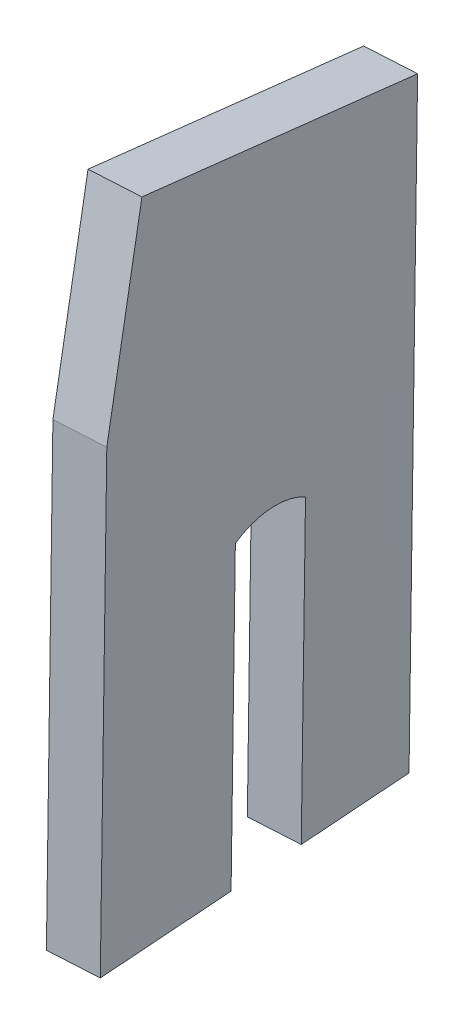
ISO-10303-21;
HEADER;
FILE_DESCRIPTION(('STEP AP214'),'2;1');
FILE_NAME('part.step','',(''),(''),'','','');
FILE_SCHEMA(('AUTOMOTIVE_DESIGN { 1 0 10303 214 1 1 1 1 }'));
ENDSEC;
DATA;
#1=APPLICATION_CONTEXT('core data for automotive mechanical design processes');
#2=APPLICATION_PROTOCOL_DEFINITION('international standard','automotive_design',2000,#1);
#3=PRODUCT_CONTEXT('',#1,'mechanical');
#4=PRODUCT('Part','Part','',(#3));
#5=PRODUCT_RELATED_PRODUCT_CATEGORY('part','',(#4));
#6=PRODUCT_DEFINITION_FORMATION('','',#4);
#7=PRODUCT_DEFINITION_CONTEXT('part definition',#1,'design');
#8=PRODUCT_DEFINITION('design','',#6,#7);
#9=PRODUCT_DEFINITION_SHAPE('','',#8);
#10=(LENGTH_UNIT() NAMED_UNIT(*) SI_UNIT(.MILLI.,.METRE.));
#11=(NAMED_UNIT(*) PLANE_ANGLE_UNIT() SI_UNIT($,.RADIAN.));
#12=(NAMED_UNIT(*) SI_UNIT($,.STERADIAN.) SOLID_ANGLE_UNIT());
#13=UNCERTAINTY_MEASURE_WITH_UNIT(LENGTH_MEASURE(1.E-05),#10,'distance_accuracy_value','');
#14=(GEOMETRIC_REPRESENTATION_CONTEXT(3) GLOBAL_UNCERTAINTY_ASSIGNED_CONTEXT((#13)) GLOBAL_UNIT_ASSIGNED_CONTEXT((#10,
#11,#12)) REPRESENTATION_CONTEXT('',''));
#15=CARTESIAN_POINT('',(0.,0.,0.));
#16=DIRECTION('',(0.,0.,1.));
#17=DIRECTION('',(1.,0.,0.));
#18=AXIS2_PLACEMENT_3D('',#15,#16,#17);
#19=CARTESIAN_POINT('',(126.75340609161,-829.436471035109,138.141208575383));
#20=DIRECTION('',(-9.43475305049383E-05,0.984578657522092,-0.174942442679125));
#21=DIRECTION('',(0.,0.174942443457746,0.984578661904184));
#22=AXIS2_PLACEMENT_3D('',#19,#20,#21);
#23=PLANE('',#22);
#24=DIRECTION('',(-0.0715965086803586,-0.174500135414766,-0.982050733254149));
#25=VECTOR('',#24,1.);
#26=CARTESIAN_POINT('',(120.419702271214,-829.357523935864,138.588939824042));
#27=LINE('',#26,#25);
#28=CARTESIAN_POINT('',(121.704287262103,-826.226641452996,156.208900007596));
#29=VERTEX_POINT('',#28);
#30=CARTESIAN_POINT('',(118.976457912932,-832.875102384852,118.792734583875));
#31=VERTEX_POINT('',#30);
#32=EDGE_CURVE('E185',#29,#31,#27,.T.);
#33=ORIENTED_EDGE('',*,*,#32,.F.);
#34=DIRECTION('',(-0.997433672503253,0.012432614054326,0.0705088580566254));
#35=VECTOR('',#34,1.);
#36=CARTESIAN_POINT('',(128.037991082499,-826.305588552241,155.761168758936));
#37=LINE('',#36,#35);
#38=CARTESIAN_POINT('',(128.037991082499,-826.305588552241,155.761168758936));
#39=VERTEX_POINT('',#38);
#40=EDGE_CURVE('E11',#39,#29,#37,.T.);
#41=ORIENTED_EDGE('',*,*,#40,.F.);
#42=DIRECTION('',(-0.0715965086803586,-0.174500135414766,-0.982050733254149));
#43=VECTOR('',#42,1.);
#44=CARTESIAN_POINT('',(126.75340609161,-829.436471035109,138.141208575383));
#45=LINE('',#44,#43);
#46=CARTESIAN_POINT('',(125.310161733328,-832.954049484097,118.345003335215));
#47=VERTEX_POINT('',#46);
#48=EDGE_CURVE('E148',#39,#47,#45,.T.);
#49=ORIENTED_EDGE('',*,*,#48,.T.);
#50=DIRECTION('',(-0.997433672503253,0.012432614054326,0.0705088580566254));
#51=VECTOR('',#50,1.);
#52=CARTESIAN_POINT('',(125.310161733328,-832.954049484097,118.345003335215));
#53=LINE('',#52,#51);
#54=EDGE_CURVE('E55',#47,#31,#53,.T.);
#55=ORIENTED_EDGE('',*,*,#54,.T.);
#56=EDGE_LOOP('',(#33,#41,#49,#55));
#57=FACE_BOUND('',#56,.T.);
#58=ADVANCED_FACE('F39',(#57),#23,.T.);
#59=CARTESIAN_POINT('',(128.037991082499,1.72056639398182,9.7578169096347));
#60=DIRECTION('',(-0.071596570844372,-0.173202539573817,-0.982280413796644));
#61=DIRECTION('',(0.,0.984807753012209,-0.173648177666924));
#62=AXIS2_PLACEMENT_3D('',#59,#60,#61);
#63=PLANE('',#62);
#64=DIRECTION('',(0.,-0.984807753012209,0.173648177666924));
#65=VECTOR('',#64,1.);
#66=CARTESIAN_POINT('',(121.704287262103,1.79951349322679,10.2055481582943));
#67=LINE('',#66,#65);
#68=CARTESIAN_POINT('',(121.704287262103,-851.2902025536,160.628282062267));
#69=VERTEX_POINT('',#68);
#70=EDGE_CURVE('E180',#29,#69,#67,.T.);
#71=ORIENTED_EDGE('',*,*,#70,.T.);
#72=DIRECTION('',(-0.997433672503253,0.012432614054326,0.0705088580566254));
#73=VECTOR('',#72,1.);
#74=CARTESIAN_POINT('',(128.037991082499,-851.369149652844,160.180550813607));
#75=LINE('',#74,#73);
#76=CARTESIAN_POINT('',(128.037991082499,-851.369149652844,160.180550813607));
#77=VERTEX_POINT('',#76);
#78=EDGE_CURVE('E47',#77,#69,#75,.T.);
#79=ORIENTED_EDGE('',*,*,#78,.F.);
#80=DIRECTION('',(0.,-0.984807753012209,0.173648177666924));
#81=VECTOR('',#80,1.);
#82=CARTESIAN_POINT('',(128.037991082499,1.72056639398182,9.7578169096347));
#83=LINE('',#82,#81);
#84=EDGE_CURVE('E145',#39,#77,#83,.T.);
#85=ORIENTED_EDGE('',*,*,#84,.F.);
#86=ORIENTED_EDGE('',*,*,#40,.T.);
#87=EDGE_LOOP('',(#71,#79,#85,#86));
#88=FACE_BOUND('',#87,.T.);
#89=ADVANCED_FACE('F206',(#88),#63,.F.);
#90=CARTESIAN_POINT('',(138.526775227402,-1.43124847286107,158.69019330866));
#91=DIRECTION('',(-0.0705251801137626,-0.000878796609681126,-0.997509612327841));
#92=DIRECTION('',(-0.997509997508162,0.,0.0705252073464942));
#93=AXIS2_PLACEMENT_3D('',#90,#91,#92);
#94=PLANE('',#93);
#95=DIRECTION('',(-0.0123396890801398,-0.999922325895514,0.00175335367524389));
#96=VECTOR('',#95,1.);
#97=CARTESIAN_POINT('',(132.193071407006,-1.3523013736161,159.137924557319));
#98=LINE('',#97,#96);
#99=CARTESIAN_POINT('',(120.986681425723,-909.439973777887,160.7302470974));
#100=VERTEX_POINT('',#99);
#101=EDGE_CURVE('E175',#69,#100,#98,.T.);
#102=ORIENTED_EDGE('',*,*,#101,.T.);
#103=DIRECTION('',(-0.997433672503253,0.012432614054326,0.0705088580566254));
#104=VECTOR('',#103,1.);
#105=CARTESIAN_POINT('',(127.320385246119,-909.518920877132,160.282515848741));
#106=LINE('',#105,#104);
#107=CARTESIAN_POINT('',(127.320385246119,-909.518920877132,160.282515848741));
#108=VERTEX_POINT('',#107);
#109=EDGE_CURVE('E168',#108,#100,#106,.T.);
#110=ORIENTED_EDGE('',*,*,#109,.F.);
#111=DIRECTION('',(-0.0123396890801398,-0.999922325895514,0.00175335367524389));
#112=VECTOR('',#111,1.);
#113=CARTESIAN_POINT('',(138.526775227402,-1.43124847286107,158.69019330866));
#114=LINE('',#113,#112);
#115=EDGE_CURVE('E141',#77,#108,#114,.T.);
#116=ORIENTED_EDGE('',*,*,#115,.F.);
#117=ORIENTED_EDGE('',*,*,#78,.T.);
#118=EDGE_LOOP('',(#102,#110,#116,#117));
#119=FACE_BOUND('',#118,.T.);
#120=ADVANCED_FACE('F174',(#119),#94,.F.);
#121=CARTESIAN_POINT('',(115.46768642663,-909.66661438917,-7.36230243311104));
#122=DIRECTION('',(0.0123396890801398,0.999922325895514,-0.00175335367524318));
#123=DIRECTION('',(-0.999923862904219,0.0123397080478226,0.));
#124=AXIS2_PLACEMENT_3D('',#121,#122,#123);
#125=PLANE('',#124);
#126=DIRECTION('',(-0.0705251801137626,-0.000878796609680408,-0.997509612327841));
#127=VECTOR('',#126,1.);
#128=CARTESIAN_POINT('',(109.133982606235,-909.587667289925,-6.91457118445146));
#129=LINE('',#128,#127);
#130=CARTESIAN_POINT('',(119.73466670207,-909.45557481985,143.021724841864));
#131=VERTEX_POINT('',#130);
#132=EDGE_CURVE('E157',#100,#131,#129,.T.);
#133=ORIENTED_EDGE('',*,*,#132,.T.);
#134=DIRECTION('',(-0.997433672503253,0.012432614054326,0.0705088580566254));
#135=VECTOR('',#134,1.);
#136=CARTESIAN_POINT('',(126.068370522465,-909.534521919095,142.573993593204));
#137=LINE('',#136,#135);
#138=CARTESIAN_POINT('',(126.068370522465,-909.534521919095,142.573993593204));
#139=VERTEX_POINT('',#138);
#140=EDGE_CURVE('E166',#139,#131,#137,.T.);
#141=ORIENTED_EDGE('',*,*,#140,.F.);
#142=DIRECTION('',(-0.0705251801137626,-0.000878796609680408,-0.997509612327841));
#143=VECTOR('',#142,1.);
#144=CARTESIAN_POINT('',(115.46768642663,-909.66661438917,-7.36230243311104));
#145=LINE('',#144,#143);
#146=EDGE_CURVE('E136',#108,#139,#145,.T.);
#147=ORIENTED_EDGE('',*,*,#146,.F.);
#148=ORIENTED_EDGE('',*,*,#109,.T.);
#149=EDGE_LOOP('',(#133,#141,#147,#148));
#150=FACE_BOUND('',#149,.T.);
#151=ADVANCED_FACE('F198',(#150),#125,.F.);
#152=CARTESIAN_POINT('',(137.274760503748,-1.44684951482426,140.981671053123));
#153=DIRECTION('',(-0.0705251801137626,-0.000878796609681253,-0.997509612327841));
#154=DIRECTION('',(-0.997509997508162,0.,0.0705252073464942));
#155=AXIS2_PLACEMENT_3D('',#152,#153,#154);
#156=PLANE('',#155);
#157=DIRECTION('',(-0.0123396890801398,-0.999922325895514,0.00175335367524402));
#158=VECTOR('',#157,1.);
#159=CARTESIAN_POINT('',(130.941056683353,-1.36790241557929,141.429402301783));
#160=LINE('',#159,#158);
#161=CARTESIAN_POINT('',(120.204808856023,-871.358534203231,142.954922066837));
#162=VERTEX_POINT('',#161);
#163=EDGE_CURVE('E184',#162,#131,#160,.T.);
#164=ORIENTED_EDGE('',*,*,#163,.F.);
#165=DIRECTION('',(-0.997433672503253,0.012432614054326,0.0705088580566254));
#166=VECTOR('',#165,1.);
#167=CARTESIAN_POINT('',(126.538512676419,-871.437481302476,142.507190818178));
#168=LINE('',#167,#166);
#169=CARTESIAN_POINT('',(126.538512676419,-871.437481302476,142.507190818178));
#170=VERTEX_POINT('',#169);
#171=EDGE_CURVE('E164',#170,#162,#168,.T.);
#172=ORIENTED_EDGE('',*,*,#171,.F.);
#173=DIRECTION('',(-0.0123396890801398,-0.999922325895514,0.00175335367524402));
#174=VECTOR('',#173,1.);
#175=CARTESIAN_POINT('',(137.274760503748,-1.44684951482426,140.981671053123));
#176=LINE('',#175,#174);
#177=EDGE_CURVE('E140',#170,#139,#176,.T.);
#178=ORIENTED_EDGE('',*,*,#177,.T.);
#179=ORIENTED_EDGE('',*,*,#140,.T.);
#180=EDGE_LOOP('',(#164,#172,#178,#179));
#181=FACE_BOUND('',#180,.T.);
#182=ADVANCED_FACE('F196',(#181),#156,.T.);
#183=CARTESIAN_POINT('',(126.100847743949,-879.689917817079,137.77101451452));
#184=DIRECTION('',(-0.997433672503253,0.012432614054326,0.0705088580566254));
#185=DIRECTION('',(0.0705143079617223,0.,0.997510768048485));
#186=AXIS2_PLACEMENT_3D('',#183,#184,#185);
#187=CYLINDRICAL_SURFACE('',#186,9.52499999999998);
#188=CARTESIAN_POINT('',(119.767143923553,-879.610970717834,138.21874576318));
#189=DIRECTION('',(0.997433672503253,-0.012432614054326,-0.0705088580566255));
#190=DIRECTION('',(-0.0705143079617224,0.,-0.997510768048485));
#191=AXIS2_PLACEMENT_3D('',#188,#189,#190);
#192=CIRCLE('',#191,9.52499999999998);
#193=CARTESIAN_POINT('',(119.533056515439,-871.366904740938,133.453643009414));
#194=VERTEX_POINT('',#193);
#195=EDGE_CURVE('E189',#194,#162,#192,.T.);
#196=ORIENTED_EDGE('',*,*,#195,.F.);
#197=DIRECTION('',(-0.997433672503253,0.012432614054326,0.0705088580566254));
#198=VECTOR('',#197,1.);
#199=CARTESIAN_POINT('',(125.866760335835,-871.445851840183,133.005911760755));
#200=LINE('',#199,#198);
#201=CARTESIAN_POINT('',(125.866760335835,-871.445851840183,133.005911760755));
#202=VERTEX_POINT('',#201);
#203=EDGE_CURVE('E131',#202,#194,#200,.T.);
#204=ORIENTED_EDGE('',*,*,#203,.F.);
#205=CARTESIAN_POINT('',(126.100847743949,-879.689917817079,137.77101451452));
#206=DIRECTION('',(0.997433672503253,-0.012432614054326,-0.0705088580566255));
#207=DIRECTION('',(-0.0705143079617224,0.,-0.997510768048485));
#208=AXIS2_PLACEMENT_3D('',#205,#206,#207);
#209=CIRCLE('',#208,9.52499999999998);
#210=EDGE_CURVE('E121',#202,#170,#209,.T.);
#211=ORIENTED_EDGE('',*,*,#210,.T.);
#212=ORIENTED_EDGE('',*,*,#171,.T.);
#213=EDGE_LOOP('',(#196,#204,#211,#212));
#214=FACE_BOUND('',#213,.T.);
#215=ADVANCED_FACE('F194',(#214),#187,.F.);
#216=CARTESIAN_POINT('',(136.603008163165,-1.45522005253147,131.480391995701));
#217=DIRECTION('',(-0.0705251801137626,-0.000878796609681278,-0.997509612327841));
#218=DIRECTION('',(-0.997509997508162,0.,0.0705252073464942));
#219=AXIS2_PLACEMENT_3D('',#216,#217,#218);
#220=PLANE('',#219);
#221=DIRECTION('',(-0.0123396890801398,-0.999922325895514,0.00175335367524405));
#222=VECTOR('',#221,1.);
#223=CARTESIAN_POINT('',(130.269304342769,-1.3762729532865,131.92812324436));
#224=LINE('',#223,#222);
#225=CARTESIAN_POINT('',(119.062914361486,-909.463945357557,133.520445784441));
#226=VERTEX_POINT('',#225);
#227=EDGE_CURVE('E128',#194,#226,#224,.T.);
#228=ORIENTED_EDGE('',*,*,#227,.T.);
#229=DIRECTION('',(-0.997433672503253,0.012432614054326,0.0705088580566254));
#230=VECTOR('',#229,1.);
#231=CARTESIAN_POINT('',(125.396618181882,-909.542892456802,133.072714535782));
#232=LINE('',#231,#230);
#233=CARTESIAN_POINT('',(125.396618181882,-909.542892456802,133.072714535782));
#234=VERTEX_POINT('',#233);
#235=EDGE_CURVE('E125',#234,#226,#232,.T.);
#236=ORIENTED_EDGE('',*,*,#235,.F.);
#237=DIRECTION('',(-0.0123396890801398,-0.999922325895514,0.00175335367524405));
#238=VECTOR('',#237,1.);
#239=CARTESIAN_POINT('',(136.603008163165,-1.45522005253147,131.480391995701));
#240=LINE('',#239,#238);
#241=EDGE_CURVE('E112',#202,#234,#240,.T.);
#242=ORIENTED_EDGE('',*,*,#241,.F.);
#243=ORIENTED_EDGE('',*,*,#203,.T.);
#244=EDGE_LOOP('',(#228,#236,#242,#243));
#245=FACE_BOUND('',#244,.T.);
#246=ADVANCED_FACE('F126',(#245),#220,.F.);
#247=CARTESIAN_POINT('',(118.031143330232,-909.476801998019,118.927054888631));
#248=VERTEX_POINT('',#247);
#249=EDGE_CURVE('E153',#226,#248,#129,.T.);
#250=ORIENTED_EDGE('',*,*,#249,.T.);
#251=DIRECTION('',(-0.997433672503253,0.012432614054326,0.0705088580566254));
#252=VECTOR('',#251,1.);
#253=CARTESIAN_POINT('',(124.364847150628,-909.555749097264,118.479323639971));
#254=LINE('',#253,#252);
#255=CARTESIAN_POINT('',(124.364847150628,-909.555749097264,118.479323639971));
#256=VERTEX_POINT('',#255);
#257=EDGE_CURVE('E84',#256,#248,#254,.T.);
#258=ORIENTED_EDGE('',*,*,#257,.F.);
#259=EDGE_CURVE('E118',#234,#256,#145,.T.);
#260=ORIENTED_EDGE('',*,*,#259,.F.);
#261=ORIENTED_EDGE('',*,*,#235,.T.);
#262=EDGE_LOOP('',(#250,#258,#260,#261));
#263=FACE_BOUND('',#262,.T.);
#264=ADVANCED_FACE('F133',(#263),#125,.F.);
#265=CARTESIAN_POINT('',(135.57123713191,-1.46807669299342,116.88700109989));
#266=DIRECTION('',(-0.0705251801137626,-0.000878796609680931,-0.997509612327841));
#267=DIRECTION('',(-0.997509997508162,0.,0.0705252073464942));
#268=AXIS2_PLACEMENT_3D('',#265,#266,#267);
#269=PLANE('',#268);
#270=DIRECTION('',(-0.0123396890801398,-0.999922325895514,0.0017533536752437));
#271=VECTOR('',#270,1.);
#272=CARTESIAN_POINT('',(129.237533311515,-1.38912959374845,117.33473234855));
#273=LINE('',#272,#271);
#274=EDGE_CURVE('E151',#31,#248,#273,.T.);
#275=ORIENTED_EDGE('',*,*,#274,.F.);
#276=ORIENTED_EDGE('',*,*,#54,.F.);
#277=DIRECTION('',(-0.0123396890801398,-0.999922325895514,0.0017533536752437));
#278=VECTOR('',#277,1.);
#279=CARTESIAN_POINT('',(135.57123713191,-1.46807669299342,116.88700109989));
#280=LINE('',#279,#278);
#281=EDGE_CURVE('E134',#47,#256,#280,.T.);
#282=ORIENTED_EDGE('',*,*,#281,.T.);
#283=ORIENTED_EDGE('',*,*,#257,.T.);
#284=EDGE_LOOP('',(#275,#276,#282,#283));
#285=FACE_BOUND('',#284,.T.);
#286=ADVANCED_FACE('F211',(#285),#269,.T.);
#287=CARTESIAN_POINT('',(126.674076407913,-1.57894198489941,-8.95462497319144));
#288=DIRECTION('',(0.997433672503253,-0.012432614054326,-0.0705088580566255));
#289=DIRECTION('',(-0.0705143079617224,0.,-0.997510768048485));
#290=AXIS2_PLACEMENT_3D('',#287,#288,#289);
#291=PLANE('',#290);
#292=ORIENTED_EDGE('',*,*,#48,.F.);
#293=ORIENTED_EDGE('',*,*,#84,.T.);
#294=ORIENTED_EDGE('',*,*,#115,.T.);
#295=ORIENTED_EDGE('',*,*,#146,.T.);
#296=ORIENTED_EDGE('',*,*,#177,.F.);
#297=ORIENTED_EDGE('',*,*,#210,.F.);
#298=ORIENTED_EDGE('',*,*,#241,.T.);
#299=ORIENTED_EDGE('',*,*,#259,.T.);
#300=ORIENTED_EDGE('',*,*,#281,.F.);
#301=EDGE_LOOP('',(#292,#293,#294,#295,#296,#297,#298,#299,#300));
#302=FACE_BOUND('',#301,.T.);
#303=ADVANCED_FACE('F115',(#302),#291,.T.);
#304=CARTESIAN_POINT('',(120.340372587518,-1.49999488565444,-8.50689372453187));
#305=DIRECTION('',(0.997433672503253,-0.012432614054326,-0.0705088580566255));
#306=DIRECTION('',(-0.0705143079617224,0.,-0.997510768048485));
#307=AXIS2_PLACEMENT_3D('',#304,#305,#306);
#308=PLANE('',#307);
#309=ORIENTED_EDGE('',*,*,#32,.T.);
#310=ORIENTED_EDGE('',*,*,#274,.T.);
#311=ORIENTED_EDGE('',*,*,#249,.F.);
#312=ORIENTED_EDGE('',*,*,#227,.F.);
#313=ORIENTED_EDGE('',*,*,#195,.T.);
#314=ORIENTED_EDGE('',*,*,#163,.T.);
#315=ORIENTED_EDGE('',*,*,#132,.F.);
#316=ORIENTED_EDGE('',*,*,#101,.F.);
#317=ORIENTED_EDGE('',*,*,#70,.F.);
#318=EDGE_LOOP('',(#309,#310,#311,#312,#313,#314,#315,#316,#317));
#319=FACE_BOUND('',#318,.T.);
#320=ADVANCED_FACE('F179',(#319),#308,.F.);
#321=CLOSED_SHELL('',(#58,#89,#120,#151,#182,#215,#246,#264,#286,#303,#320));
#322=MANIFOLD_SOLID_BREP('B2',#321);
#323=ADVANCED_BREP_SHAPE_REPRESENTATION('',(#18,#322),#14);
#324=SHAPE_DEFINITION_REPRESENTATION(#9,#323);
ENDSEC;
END-ISO-10303-21;
